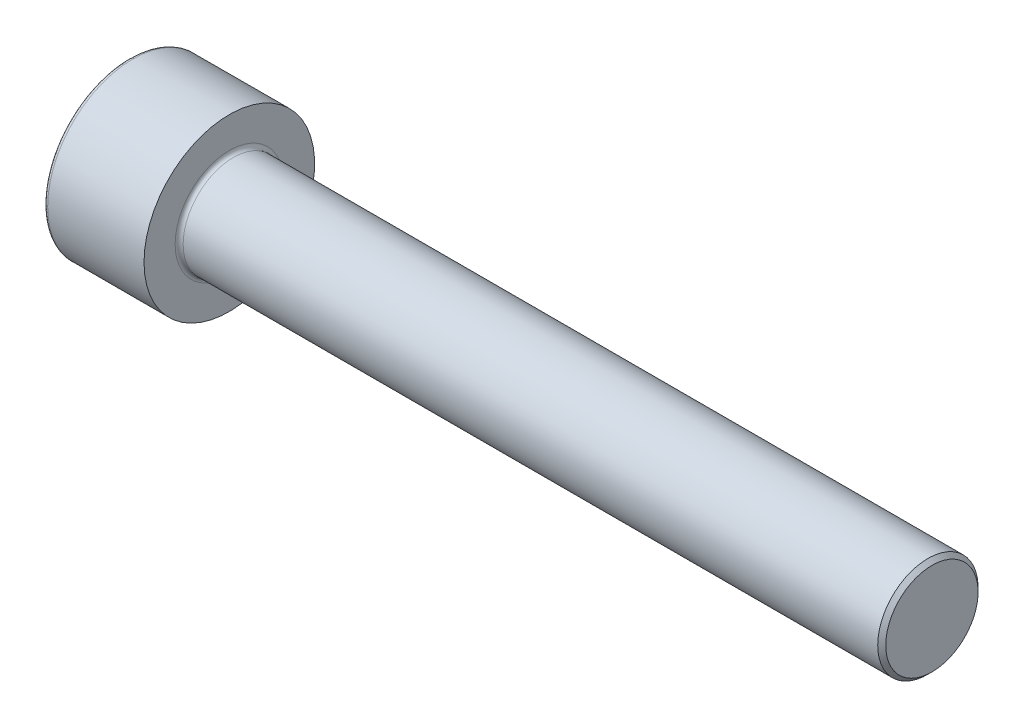
ISO-10303-21;
HEADER;
FILE_DESCRIPTION(('STEP AP214'),'2;1');
FILE_NAME('part.step','',(''),(''),'','','');
FILE_SCHEMA(('AUTOMOTIVE_DESIGN { 1 0 10303 214 1 1 1 1 }'));
ENDSEC;
DATA;
#1=APPLICATION_CONTEXT('core data for automotive mechanical design processes');
#2=APPLICATION_PROTOCOL_DEFINITION('international standard','automotive_design',2000,#1);
#3=PRODUCT_CONTEXT('',#1,'mechanical');
#4=PRODUCT('Part','Part','',(#3));
#5=PRODUCT_RELATED_PRODUCT_CATEGORY('part','',(#4));
#6=PRODUCT_DEFINITION_FORMATION('','',#4);
#7=PRODUCT_DEFINITION_CONTEXT('part definition',#1,'design');
#8=PRODUCT_DEFINITION('design','',#6,#7);
#9=PRODUCT_DEFINITION_SHAPE('','',#8);
#10=(LENGTH_UNIT() NAMED_UNIT(*) SI_UNIT(.MILLI.,.METRE.));
#11=(NAMED_UNIT(*) PLANE_ANGLE_UNIT() SI_UNIT($,.RADIAN.));
#12=(NAMED_UNIT(*) SI_UNIT($,.STERADIAN.) SOLID_ANGLE_UNIT());
#13=UNCERTAINTY_MEASURE_WITH_UNIT(LENGTH_MEASURE(1.E-05),#10,'distance_accuracy_value','');
#14=(GEOMETRIC_REPRESENTATION_CONTEXT(3) GLOBAL_UNCERTAINTY_ASSIGNED_CONTEXT((#13)) GLOBAL_UNIT_ASSIGNED_CONTEXT((#10,
#11,#12)) REPRESENTATION_CONTEXT('',''));
#15=CARTESIAN_POINT('',(0.,0.,0.));
#16=DIRECTION('',(0.,0.,1.));
#17=DIRECTION('',(1.,0.,0.));
#18=AXIS2_PLACEMENT_3D('',#15,#16,#17);
#19=CARTESIAN_POINT('',(0.,0.,0.));
#20=DIRECTION('',(1.,0.,0.));
#21=DIRECTION('',(0.,0.,-1.));
#22=AXIS2_PLACEMENT_3D('',#19,#20,#21);
#23=PLANE('',#22);
#24=DIRECTION('',(0.,0.5,0.866025403784439));
#25=VECTOR('',#24,1.);
#26=CARTESIAN_POINT('',(0.,-2.3094010767585,0.));
#27=LINE('',#26,#25);
#28=CARTESIAN_POINT('',(0.,-2.3094010767585,0.));
#29=VERTEX_POINT('',#28);
#30=CARTESIAN_POINT('',(0.,-1.15470053837925,2.));
#31=VERTEX_POINT('',#30);
#32=EDGE_CURVE('E51',#29,#31,#27,.T.);
#33=ORIENTED_EDGE('',*,*,#32,.F.);
#34=DIRECTION('',(0.,-0.5,0.866025403784439));
#35=VECTOR('',#34,1.);
#36=CARTESIAN_POINT('',(0.,-1.15470053837925,-2.));
#37=LINE('',#36,#35);
#38=CARTESIAN_POINT('',(0.,-1.15470053837925,-2.));
#39=VERTEX_POINT('',#38);
#40=EDGE_CURVE('E127',#39,#29,#37,.T.);
#41=ORIENTED_EDGE('',*,*,#40,.F.);
#42=DIRECTION('',(0.,-1.,0.));
#43=VECTOR('',#42,1.);
#44=CARTESIAN_POINT('',(0.,1.15470053837925,-2.));
#45=LINE('',#44,#43);
#46=CARTESIAN_POINT('',(0.,1.15470053837925,-2.));
#47=VERTEX_POINT('',#46);
#48=EDGE_CURVE('E121',#47,#39,#45,.T.);
#49=ORIENTED_EDGE('',*,*,#48,.F.);
#50=DIRECTION('',(0.,-0.5,-0.866025403784439));
#51=VECTOR('',#50,1.);
#52=CARTESIAN_POINT('',(0.,2.3094010767585,0.));
#53=LINE('',#52,#51);
#54=CARTESIAN_POINT('',(0.,2.3094010767585,0.));
#55=VERTEX_POINT('',#54);
#56=EDGE_CURVE('E159',#55,#47,#53,.T.);
#57=ORIENTED_EDGE('',*,*,#56,.F.);
#58=DIRECTION('',(0.,0.5,-0.866025403784439));
#59=VECTOR('',#58,1.);
#60=CARTESIAN_POINT('',(0.,1.15470053837925,2.));
#61=LINE('',#60,#59);
#62=CARTESIAN_POINT('',(0.,1.15470053837925,2.));
#63=VERTEX_POINT('',#62);
#64=EDGE_CURVE('E156',#63,#55,#61,.T.);
#65=ORIENTED_EDGE('',*,*,#64,.F.);
#66=DIRECTION('',(0.,1.,0.));
#67=VECTOR('',#66,1.);
#68=CARTESIAN_POINT('',(0.,-1.15470053837925,2.));
#69=LINE('',#68,#67);
#70=EDGE_CURVE('E153',#31,#63,#69,.T.);
#71=ORIENTED_EDGE('',*,*,#70,.F.);
#72=EDGE_LOOP('',(#33,#41,#49,#57,#65,#71));
#73=FACE_BOUND('',#72,.T.);
#74=CARTESIAN_POINT('',(0.,0.,0.));
#75=DIRECTION('',(1.,0.,0.));
#76=DIRECTION('',(0.,0.,-1.));
#77=AXIS2_PLACEMENT_3D('',#74,#75,#76);
#78=CIRCLE('',#77,4.05);
#79=CARTESIAN_POINT('',(0.,0.,-4.05));
#80=VERTEX_POINT('',#79);
#81=EDGE_CURVE('E191',#80,#80,#78,.F.);
#82=ORIENTED_EDGE('',*,*,#81,.T.);
#83=EDGE_LOOP('',(#82));
#84=FACE_BOUND('',#83,.T.);
#85=ADVANCED_FACE('F36',(#73,#84),#23,.F.);
#86=CARTESIAN_POINT('',(0.,0.,0.));
#87=DIRECTION('',(-1.,0.,0.));
#88=DIRECTION('',(0.,0.,1.));
#89=AXIS2_PLACEMENT_3D('',#86,#87,#88);
#90=CYLINDRICAL_SURFACE('',#89,4.25);
#91=CARTESIAN_POINT('',(0.2,0.,0.));
#92=DIRECTION('',(1.,0.,0.));
#93=DIRECTION('',(0.,0.,-1.));
#94=AXIS2_PLACEMENT_3D('',#91,#92,#93);
#95=CIRCLE('',#94,4.25);
#96=CARTESIAN_POINT('',(0.2,0.,-4.25));
#97=VERTEX_POINT('',#96);
#98=EDGE_CURVE('E194',#97,#97,#95,.T.);
#99=ORIENTED_EDGE('',*,*,#98,.T.);
#100=EDGE_LOOP('',(#99));
#101=FACE_BOUND('',#100,.T.);
#102=CARTESIAN_POINT('',(5.,0.,0.));
#103=DIRECTION('',(-1.,0.,0.));
#104=DIRECTION('',(0.,0.,1.));
#105=AXIS2_PLACEMENT_3D('',#102,#103,#104);
#106=CIRCLE('',#105,4.25);
#107=CARTESIAN_POINT('',(5.,0.,4.25));
#108=VERTEX_POINT('',#107);
#109=EDGE_CURVE('E181',#108,#108,#106,.T.);
#110=ORIENTED_EDGE('',*,*,#109,.T.);
#111=EDGE_LOOP('',(#110));
#112=FACE_BOUND('',#111,.T.);
#113=ADVANCED_FACE('F213',(#101,#112),#90,.T.);
#114=CARTESIAN_POINT('',(5.,4.25,0.));
#115=DIRECTION('',(-1.,0.,0.));
#116=DIRECTION('',(0.,0.,1.));
#117=AXIS2_PLACEMENT_3D('',#114,#115,#116);
#118=PLANE('',#117);
#119=CARTESIAN_POINT('',(5.,0.,0.));
#120=DIRECTION('',(-1.,0.,0.));
#121=DIRECTION('',(0.,0.,1.));
#122=AXIS2_PLACEMENT_3D('',#119,#120,#121);
#123=CIRCLE('',#122,2.7);
#124=CARTESIAN_POINT('',(5.,0.,2.7));
#125=VERTEX_POINT('',#124);
#126=EDGE_CURVE('E44',#125,#125,#123,.T.);
#127=ORIENTED_EDGE('',*,*,#126,.T.);
#128=EDGE_LOOP('',(#127));
#129=FACE_BOUND('',#128,.T.);
#130=ORIENTED_EDGE('',*,*,#109,.F.);
#131=EDGE_LOOP('',(#130));
#132=FACE_BOUND('',#131,.T.);
#133=ADVANCED_FACE('F199',(#129,#132),#118,.F.);
#134=CARTESIAN_POINT('',(0.,0.,0.));
#135=DIRECTION('',(-1.,0.,0.));
#136=DIRECTION('',(0.,0.,1.));
#137=AXIS2_PLACEMENT_3D('',#134,#135,#136);
#138=CYLINDRICAL_SURFACE('',#137,2.5);
#139=CARTESIAN_POINT('',(5.2,0.,0.));
#140=DIRECTION('',(-1.,0.,0.));
#141=DIRECTION('',(0.,0.,1.));
#142=AXIS2_PLACEMENT_3D('',#139,#140,#141);
#143=CIRCLE('',#142,2.5);
#144=CARTESIAN_POINT('',(5.2,0.,2.5));
#145=VERTEX_POINT('',#144);
#146=EDGE_CURVE('E11',#145,#145,#143,.F.);
#147=ORIENTED_EDGE('',*,*,#146,.T.);
#148=EDGE_LOOP('',(#147));
#149=FACE_BOUND('',#148,.T.);
#150=CARTESIAN_POINT('',(39.8,0.,0.));
#151=DIRECTION('',(-1.,0.,0.));
#152=DIRECTION('',(0.,0.,1.));
#153=AXIS2_PLACEMENT_3D('',#150,#151,#152);
#154=CIRCLE('',#153,2.5);
#155=CARTESIAN_POINT('',(39.8,0.,2.5));
#156=VERTEX_POINT('',#155);
#157=EDGE_CURVE('E185',#156,#156,#154,.T.);
#158=ORIENTED_EDGE('',*,*,#157,.T.);
#159=EDGE_LOOP('',(#158));
#160=FACE_BOUND('',#159,.T.);
#161=ADVANCED_FACE('F241',(#149,#160),#138,.T.);
#162=CARTESIAN_POINT('',(40.,2.5,0.));
#163=DIRECTION('',(-1.,0.,0.));
#164=DIRECTION('',(0.,0.,1.));
#165=AXIS2_PLACEMENT_3D('',#162,#163,#164);
#166=PLANE('',#165);
#167=CARTESIAN_POINT('',(40.,0.,0.));
#168=DIRECTION('',(-1.,0.,0.));
#169=DIRECTION('',(0.,0.,1.));
#170=AXIS2_PLACEMENT_3D('',#167,#168,#169);
#171=CIRCLE('',#170,2.30000000000001);
#172=CARTESIAN_POINT('',(40.,0.,2.30000000000001));
#173=VERTEX_POINT('',#172);
#174=EDGE_CURVE('E188',#173,#173,#171,.F.);
#175=ORIENTED_EDGE('',*,*,#174,.T.);
#176=EDGE_LOOP('',(#175));
#177=FACE_BOUND('',#176,.T.);
#178=ADVANCED_FACE('F226',(#177),#166,.F.);
#179=CARTESIAN_POINT('',(39.8,0.,0.));
#180=DIRECTION('',(-1.,0.,0.));
#181=DIRECTION('',(0.,0.,1.));
#182=AXIS2_PLACEMENT_3D('',#179,#180,#181);
#183=CONICAL_SURFACE('',#182,2.5,0.785398163397443);
#184=ORIENTED_EDGE('',*,*,#174,.F.);
#185=EDGE_LOOP('',(#184));
#186=FACE_BOUND('',#185,.T.);
#187=ORIENTED_EDGE('',*,*,#157,.F.);
#188=EDGE_LOOP('',(#187));
#189=FACE_BOUND('',#188,.T.);
#190=ADVANCED_FACE('F223',(#186,#189),#183,.T.);
#191=CARTESIAN_POINT('',(0.2,0.,0.));
#192=DIRECTION('',(1.,0.,0.));
#193=DIRECTION('',(0.,0.,-1.));
#194=AXIS2_PLACEMENT_3D('',#191,#192,#193);
#195=TOROIDAL_SURFACE('',#194,4.05,0.2);
#196=ORIENTED_EDGE('',*,*,#98,.F.);
#197=EDGE_LOOP('',(#196));
#198=FACE_BOUND('',#197,.T.);
#199=ORIENTED_EDGE('',*,*,#81,.F.);
#200=EDGE_LOOP('',(#199));
#201=FACE_BOUND('',#200,.T.);
#202=ADVANCED_FACE('F225',(#198,#201),#195,.T.);
#203=CARTESIAN_POINT('',(2.5,-1.15470053837925,-2.));
#204=DIRECTION('',(0.,-0.866025403784439,-0.5));
#205=DIRECTION('',(0.,0.5,-0.866025403784439));
#206=AXIS2_PLACEMENT_3D('',#203,#204,#205);
#207=PLANE('',#206);
#208=ORIENTED_EDGE('',*,*,#40,.T.);
#209=DIRECTION('',(-1.,0.,0.));
#210=VECTOR('',#209,1.);
#211=CARTESIAN_POINT('',(2.5,-2.3094010767585,0.));
#212=LINE('',#211,#210);
#213=CARTESIAN_POINT('',(2.5,-2.3094010767585,0.));
#214=VERTEX_POINT('',#213);
#215=EDGE_CURVE('E124',#214,#29,#212,.T.);
#216=ORIENTED_EDGE('',*,*,#215,.F.);
#217=DIRECTION('',(0.,-0.5,0.866025403784439));
#218=VECTOR('',#217,1.);
#219=CARTESIAN_POINT('',(2.5,-1.15470053837925,-2.));
#220=LINE('',#219,#218);
#221=CARTESIAN_POINT('',(2.5,-1.73205080756888,-1.));
#222=VERTEX_POINT('',#221);
#223=EDGE_CURVE('E110',#222,#214,#220,.T.);
#224=ORIENTED_EDGE('',*,*,#223,.F.);
#225=CARTESIAN_POINT('',(2.5,-1.15470053837925,-2.));
#226=VERTEX_POINT('',#225);
#227=EDGE_CURVE('E120',#226,#222,#220,.T.);
#228=ORIENTED_EDGE('',*,*,#227,.F.);
#229=DIRECTION('',(-1.,0.,0.));
#230=VECTOR('',#229,1.);
#231=CARTESIAN_POINT('',(2.5,-1.15470053837925,-2.));
#232=LINE('',#231,#230);
#233=EDGE_CURVE('E164',#226,#39,#232,.T.);
#234=ORIENTED_EDGE('',*,*,#233,.T.);
#235=EDGE_LOOP('',(#208,#216,#224,#228,#234));
#236=FACE_BOUND('',#235,.T.);
#237=ADVANCED_FACE('F125',(#236),#207,.F.);
#238=CARTESIAN_POINT('',(2.5,1.15470053837925,-2.));
#239=DIRECTION('',(0.,0.,-1.));
#240=DIRECTION('',(-1.,0.,0.));
#241=AXIS2_PLACEMENT_3D('',#238,#239,#240);
#242=PLANE('',#241);
#243=ORIENTED_EDGE('',*,*,#48,.T.);
#244=ORIENTED_EDGE('',*,*,#233,.F.);
#245=DIRECTION('',(0.,-1.,0.));
#246=VECTOR('',#245,1.);
#247=CARTESIAN_POINT('',(2.5,1.15470053837925,-2.));
#248=LINE('',#247,#246);
#249=CARTESIAN_POINT('',(2.5,0.,-2.));
#250=VERTEX_POINT('',#249);
#251=EDGE_CURVE('E148',#250,#226,#248,.T.);
#252=ORIENTED_EDGE('',*,*,#251,.F.);
#253=CARTESIAN_POINT('',(2.5,1.15470053837925,-2.));
#254=VERTEX_POINT('',#253);
#255=EDGE_CURVE('E130',#254,#250,#248,.T.);
#256=ORIENTED_EDGE('',*,*,#255,.F.);
#257=DIRECTION('',(-1.,0.,0.));
#258=VECTOR('',#257,1.);
#259=CARTESIAN_POINT('',(2.5,1.15470053837925,-2.));
#260=LINE('',#259,#258);
#261=EDGE_CURVE('E167',#254,#47,#260,.T.);
#262=ORIENTED_EDGE('',*,*,#261,.T.);
#263=EDGE_LOOP('',(#243,#244,#252,#256,#262));
#264=FACE_BOUND('',#263,.T.);
#265=ADVANCED_FACE('F233',(#264),#242,.F.);
#266=CARTESIAN_POINT('',(2.5,2.3094010767585,0.));
#267=DIRECTION('',(0.,0.866025403784439,-0.5));
#268=DIRECTION('',(0.,0.5,0.866025403784439));
#269=AXIS2_PLACEMENT_3D('',#266,#267,#268);
#270=PLANE('',#269);
#271=ORIENTED_EDGE('',*,*,#56,.T.);
#272=ORIENTED_EDGE('',*,*,#261,.F.);
#273=DIRECTION('',(0.,-0.5,-0.866025403784439));
#274=VECTOR('',#273,1.);
#275=CARTESIAN_POINT('',(2.5,2.3094010767585,0.));
#276=LINE('',#275,#274);
#277=CARTESIAN_POINT('',(2.5,1.73205080756888,-1.));
#278=VERTEX_POINT('',#277);
#279=EDGE_CURVE('E144',#278,#254,#276,.T.);
#280=ORIENTED_EDGE('',*,*,#279,.F.);
#281=CARTESIAN_POINT('',(2.5,2.3094010767585,0.));
#282=VERTEX_POINT('',#281);
#283=EDGE_CURVE('E145',#282,#278,#276,.T.);
#284=ORIENTED_EDGE('',*,*,#283,.F.);
#285=DIRECTION('',(-1.,0.,0.));
#286=VECTOR('',#285,1.);
#287=CARTESIAN_POINT('',(2.5,2.3094010767585,0.));
#288=LINE('',#287,#286);
#289=EDGE_CURVE('E170',#282,#55,#288,.T.);
#290=ORIENTED_EDGE('',*,*,#289,.T.);
#291=EDGE_LOOP('',(#271,#272,#280,#284,#290));
#292=FACE_BOUND('',#291,.T.);
#293=ADVANCED_FACE('F261',(#292),#270,.F.);
#294=CARTESIAN_POINT('',(2.5,1.15470053837925,2.));
#295=DIRECTION('',(0.,0.866025403784439,0.5));
#296=DIRECTION('',(0.,-0.5,0.866025403784439));
#297=AXIS2_PLACEMENT_3D('',#294,#295,#296);
#298=PLANE('',#297);
#299=ORIENTED_EDGE('',*,*,#64,.T.);
#300=ORIENTED_EDGE('',*,*,#289,.F.);
#301=DIRECTION('',(0.,0.5,-0.866025403784439));
#302=VECTOR('',#301,1.);
#303=CARTESIAN_POINT('',(2.5,1.15470053837925,2.));
#304=LINE('',#303,#302);
#305=CARTESIAN_POINT('',(2.5,1.73205080756888,0.999999999999999));
#306=VERTEX_POINT('',#305);
#307=EDGE_CURVE('E142',#306,#282,#304,.T.);
#308=ORIENTED_EDGE('',*,*,#307,.F.);
#309=CARTESIAN_POINT('',(2.5,1.15470053837925,2.));
#310=VERTEX_POINT('',#309);
#311=EDGE_CURVE('E59',#310,#306,#304,.T.);
#312=ORIENTED_EDGE('',*,*,#311,.F.);
#313=DIRECTION('',(-1.,0.,0.));
#314=VECTOR('',#313,1.);
#315=CARTESIAN_POINT('',(2.5,1.15470053837925,2.));
#316=LINE('',#315,#314);
#317=EDGE_CURVE('E173',#310,#63,#316,.T.);
#318=ORIENTED_EDGE('',*,*,#317,.T.);
#319=EDGE_LOOP('',(#299,#300,#308,#312,#318));
#320=FACE_BOUND('',#319,.T.);
#321=ADVANCED_FACE('F257',(#320),#298,.F.);
#322=CARTESIAN_POINT('',(2.5,-1.15470053837925,2.));
#323=DIRECTION('',(0.,0.,1.));
#324=DIRECTION('',(1.,0.,0.));
#325=AXIS2_PLACEMENT_3D('',#322,#323,#324);
#326=PLANE('',#325);
#327=ORIENTED_EDGE('',*,*,#70,.T.);
#328=ORIENTED_EDGE('',*,*,#317,.F.);
#329=DIRECTION('',(0.,1.,0.));
#330=VECTOR('',#329,1.);
#331=CARTESIAN_POINT('',(2.5,-1.15470053837925,2.));
#332=LINE('',#331,#330);
#333=CARTESIAN_POINT('',(2.5,0.,2.));
#334=VERTEX_POINT('',#333);
#335=EDGE_CURVE('E136',#334,#310,#332,.T.);
#336=ORIENTED_EDGE('',*,*,#335,.F.);
#337=CARTESIAN_POINT('',(2.5,-1.15470053837925,2.));
#338=VERTEX_POINT('',#337);
#339=EDGE_CURVE('E138',#338,#334,#332,.T.);
#340=ORIENTED_EDGE('',*,*,#339,.F.);
#341=DIRECTION('',(-1.,0.,0.));
#342=VECTOR('',#341,1.);
#343=CARTESIAN_POINT('',(2.5,-1.15470053837925,2.));
#344=LINE('',#343,#342);
#345=EDGE_CURVE('E129',#338,#31,#344,.T.);
#346=ORIENTED_EDGE('',*,*,#345,.T.);
#347=EDGE_LOOP('',(#327,#328,#336,#340,#346));
#348=FACE_BOUND('',#347,.T.);
#349=ADVANCED_FACE('F254',(#348),#326,.F.);
#350=CARTESIAN_POINT('',(2.5,-2.3094010767585,0.));
#351=DIRECTION('',(0.,-0.866025403784439,0.5));
#352=DIRECTION('',(0.,-0.5,-0.866025403784439));
#353=AXIS2_PLACEMENT_3D('',#350,#351,#352);
#354=PLANE('',#353);
#355=ORIENTED_EDGE('',*,*,#32,.T.);
#356=ORIENTED_EDGE('',*,*,#345,.F.);
#357=DIRECTION('',(0.,0.5,0.866025403784439));
#358=VECTOR('',#357,1.);
#359=CARTESIAN_POINT('',(2.5,-2.3094010767585,0.));
#360=LINE('',#359,#358);
#361=CARTESIAN_POINT('',(2.5,-1.73205080756888,1.));
#362=VERTEX_POINT('',#361);
#363=EDGE_CURVE('E135',#362,#338,#360,.T.);
#364=ORIENTED_EDGE('',*,*,#363,.F.);
#365=EDGE_CURVE('E114',#214,#362,#360,.T.);
#366=ORIENTED_EDGE('',*,*,#365,.F.);
#367=ORIENTED_EDGE('',*,*,#215,.T.);
#368=EDGE_LOOP('',(#355,#356,#364,#366,#367));
#369=FACE_BOUND('',#368,.T.);
#370=ADVANCED_FACE('F133',(#369),#354,.F.);
#371=CARTESIAN_POINT('',(2.5,0.,0.));
#372=DIRECTION('',(-1.,0.,0.));
#373=DIRECTION('',(0.,0.,1.));
#374=AXIS2_PLACEMENT_3D('',#371,#372,#373);
#375=PLANE('',#374);
#376=CARTESIAN_POINT('',(2.5,0.,0.));
#377=DIRECTION('',(-1.,0.,0.));
#378=DIRECTION('',(0.,0.,1.));
#379=AXIS2_PLACEMENT_3D('',#376,#377,#378);
#380=CIRCLE('',#379,2.);
#381=EDGE_CURVE('E166',#362,#334,#380,.T.);
#382=ORIENTED_EDGE('',*,*,#381,.F.);
#383=ORIENTED_EDGE('',*,*,#363,.T.);
#384=ORIENTED_EDGE('',*,*,#339,.T.);
#385=EDGE_LOOP('',(#382,#383,#384));
#386=FACE_BOUND('',#385,.T.);
#387=ADVANCED_FACE('F253',(#386),#375,.T.);
#388=EDGE_CURVE('E116',#222,#362,#380,.T.);
#389=ORIENTED_EDGE('',*,*,#388,.F.);
#390=ORIENTED_EDGE('',*,*,#223,.T.);
#391=ORIENTED_EDGE('',*,*,#365,.T.);
#392=EDGE_LOOP('',(#389,#390,#391));
#393=FACE_BOUND('',#392,.T.);
#394=ADVANCED_FACE('F112',(#393),#375,.T.);
#395=EDGE_CURVE('E289',#250,#222,#380,.T.);
#396=ORIENTED_EDGE('',*,*,#395,.F.);
#397=ORIENTED_EDGE('',*,*,#251,.T.);
#398=ORIENTED_EDGE('',*,*,#227,.T.);
#399=EDGE_LOOP('',(#396,#397,#398));
#400=FACE_BOUND('',#399,.T.);
#401=ADVANCED_FACE('F274',(#400),#375,.T.);
#402=EDGE_CURVE('E290',#278,#250,#380,.T.);
#403=ORIENTED_EDGE('',*,*,#402,.F.);
#404=ORIENTED_EDGE('',*,*,#279,.T.);
#405=ORIENTED_EDGE('',*,*,#255,.T.);
#406=EDGE_LOOP('',(#403,#404,#405));
#407=FACE_BOUND('',#406,.T.);
#408=ADVANCED_FACE('F280',(#407),#375,.T.);
#409=EDGE_CURVE('E182',#306,#278,#380,.T.);
#410=ORIENTED_EDGE('',*,*,#409,.F.);
#411=ORIENTED_EDGE('',*,*,#307,.T.);
#412=ORIENTED_EDGE('',*,*,#283,.T.);
#413=EDGE_LOOP('',(#410,#411,#412));
#414=FACE_BOUND('',#413,.T.);
#415=ADVANCED_FACE('F276',(#414),#375,.T.);
#416=EDGE_CURVE('E178',#334,#306,#380,.T.);
#417=ORIENTED_EDGE('',*,*,#416,.F.);
#418=ORIENTED_EDGE('',*,*,#335,.T.);
#419=ORIENTED_EDGE('',*,*,#311,.T.);
#420=EDGE_LOOP('',(#417,#418,#419));
#421=FACE_BOUND('',#420,.T.);
#422=ADVANCED_FACE('F208',(#421),#375,.T.);
#423=CARTESIAN_POINT('',(2.5,0.,0.));
#424=DIRECTION('',(-1.,0.,0.));
#425=DIRECTION('',(0.,0.,1.));
#426=AXIS2_PLACEMENT_3D('',#423,#424,#425);
#427=CONICAL_SURFACE('',#426,2.,1.02974425867665);
#428=CARTESIAN_POINT('',(3.70172123805512,0.,0.));
#429=VERTEX_POINT('',#428);
#430=VERTEX_LOOP('',#429);
#431=FACE_BOUND('',#430,.T.);
#432=ORIENTED_EDGE('',*,*,#416,.T.);
#433=ORIENTED_EDGE('',*,*,#409,.T.);
#434=ORIENTED_EDGE('',*,*,#402,.T.);
#435=ORIENTED_EDGE('',*,*,#395,.T.);
#436=ORIENTED_EDGE('',*,*,#388,.T.);
#437=ORIENTED_EDGE('',*,*,#381,.T.);
#438=EDGE_LOOP('',(#432,#433,#434,#435,#436,#437));
#439=FACE_BOUND('',#438,.T.);
#440=ADVANCED_FACE('F203',(#431,#439),#427,.F.);
#441=CARTESIAN_POINT('',(5.2,0.,0.));
#442=DIRECTION('',(-1.,0.,0.));
#443=DIRECTION('',(0.,0.,1.));
#444=AXIS2_PLACEMENT_3D('',#441,#442,#443);
#445=TOROIDAL_SURFACE('',#444,2.7,0.2);
#446=ORIENTED_EDGE('',*,*,#146,.F.);
#447=EDGE_LOOP('',(#446));
#448=FACE_BOUND('',#447,.T.);
#449=ORIENTED_EDGE('',*,*,#126,.F.);
#450=EDGE_LOOP('',(#449));
#451=FACE_BOUND('',#450,.T.);
#452=ADVANCED_FACE('F38',(#448,#451),#445,.F.);
#453=CLOSED_SHELL('',(#85,#113,#133,#161,#178,#190,#202,#237,#265,#293,#321,#349,#370,#387,#394,
#401,#408,#415,#422,#440,#452));
#454=MANIFOLD_SOLID_BREP('B2',#453);
#455=ADVANCED_BREP_SHAPE_REPRESENTATION('',(#18,#454),#14);
#456=SHAPE_DEFINITION_REPRESENTATION(#9,#455);
ENDSEC;
END-ISO-10303-21;
